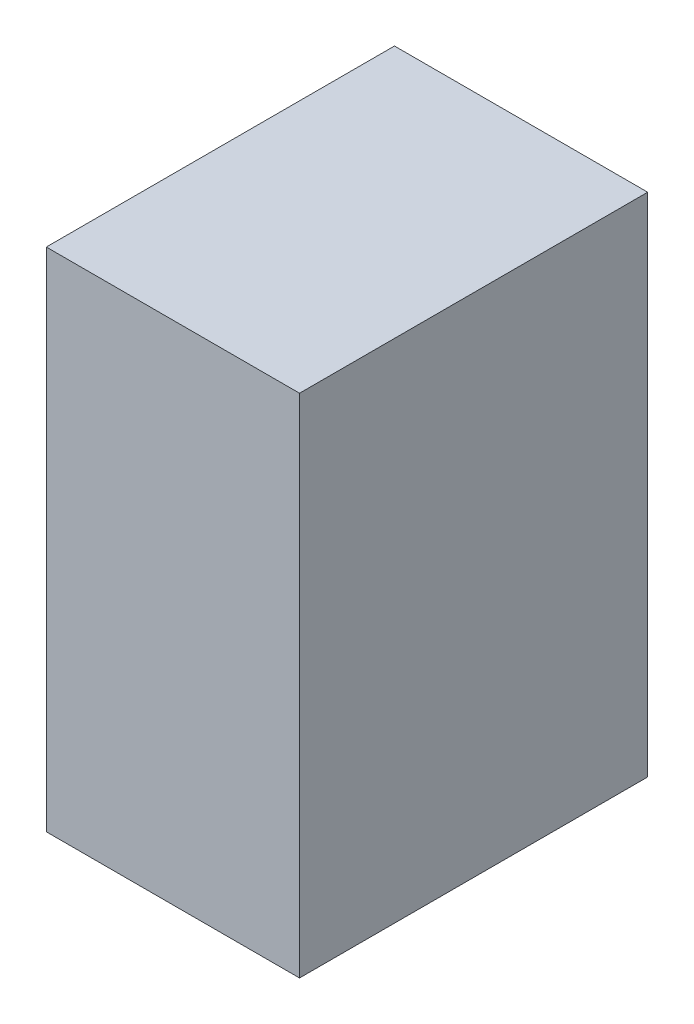
ISO-10303-21;
HEADER;
FILE_DESCRIPTION(('STEP AP214'),'2;1');
FILE_NAME('part.step','',(''),(''),'','','');
FILE_SCHEMA(('AUTOMOTIVE_DESIGN { 1 0 10303 214 1 1 1 1 }'));
ENDSEC;
DATA;
#1=APPLICATION_CONTEXT('core data for automotive mechanical design processes');
#2=APPLICATION_PROTOCOL_DEFINITION('international standard','automotive_design',2000,#1);
#3=PRODUCT_CONTEXT('',#1,'mechanical');
#4=PRODUCT('Part','Part','',(#3));
#5=PRODUCT_RELATED_PRODUCT_CATEGORY('part','',(#4));
#6=PRODUCT_DEFINITION_FORMATION('','',#4);
#7=PRODUCT_DEFINITION_CONTEXT('part definition',#1,'design');
#8=PRODUCT_DEFINITION('design','',#6,#7);
#9=PRODUCT_DEFINITION_SHAPE('','',#8);
#10=(LENGTH_UNIT() NAMED_UNIT(*) SI_UNIT(.MILLI.,.METRE.));
#11=(NAMED_UNIT(*) PLANE_ANGLE_UNIT() SI_UNIT($,.RADIAN.));
#12=(NAMED_UNIT(*) SI_UNIT($,.STERADIAN.) SOLID_ANGLE_UNIT());
#13=UNCERTAINTY_MEASURE_WITH_UNIT(LENGTH_MEASURE(1.E-05),#10,'distance_accuracy_value','');
#14=(GEOMETRIC_REPRESENTATION_CONTEXT(3) GLOBAL_UNCERTAINTY_ASSIGNED_CONTEXT((#13)) GLOBAL_UNIT_ASSIGNED_CONTEXT((#10,
#11,#12)) REPRESENTATION_CONTEXT('',''));
#15=CARTESIAN_POINT('',(0.,0.,0.));
#16=DIRECTION('',(0.,0.,1.));
#17=DIRECTION('',(1.,0.,0.));
#18=AXIS2_PLACEMENT_3D('',#15,#16,#17);
#19=CARTESIAN_POINT('',(-0.1999996,0.3999992,0.));
#20=DIRECTION('',(1.,0.,0.));
#21=DIRECTION('',(0.,0.,-1.));
#22=AXIS2_PLACEMENT_3D('',#19,#20,#21);
#23=PLANE('',#22);
#24=DIRECTION('',(0.,0.,1.));
#25=VECTOR('',#24,1.);
#26=CARTESIAN_POINT('',(-0.1999996,-0.3999992,0.));
#27=LINE('',#26,#25);
#28=CARTESIAN_POINT('',(-0.1999996,-0.3999992,0.));
#29=VERTEX_POINT('',#28);
#30=CARTESIAN_POINT('',(-0.1999996,-0.3999992,0.5499989));
#31=VERTEX_POINT('',#30);
#32=EDGE_CURVE('E20',#29,#31,#27,.T.);
#33=ORIENTED_EDGE('',*,*,#32,.T.);
#34=DIRECTION('',(0.,1.,0.));
#35=VECTOR('',#34,1.);
#36=CARTESIAN_POINT('',(-0.1999996,-0.3999992,0.5499989));
#37=LINE('',#36,#35);
#38=CARTESIAN_POINT('',(-0.1999996,0.3999992,0.5499989));
#39=VERTEX_POINT('',#38);
#40=EDGE_CURVE('E55',#31,#39,#37,.T.);
#41=ORIENTED_EDGE('',*,*,#40,.T.);
#42=DIRECTION('',(0.,0.,-1.));
#43=VECTOR('',#42,1.);
#44=CARTESIAN_POINT('',(-0.1999996,0.3999992,0.));
#45=LINE('',#44,#43);
#46=CARTESIAN_POINT('',(-0.1999996,0.3999992,0.));
#47=VERTEX_POINT('',#46);
#48=EDGE_CURVE('E76',#39,#47,#45,.T.);
#49=ORIENTED_EDGE('',*,*,#48,.T.);
#50=DIRECTION('',(0.,1.,0.));
#51=VECTOR('',#50,1.);
#52=CARTESIAN_POINT('',(-0.1999996,-0.3999992,0.));
#53=LINE('',#52,#51);
#54=EDGE_CURVE('E58',#29,#47,#53,.T.);
#55=ORIENTED_EDGE('',*,*,#54,.F.);
#56=EDGE_LOOP('',(#33,#41,#49,#55));
#57=FACE_BOUND('',#56,.T.);
#58=ADVANCED_FACE('F17',(#57),#23,.F.);
#59=CARTESIAN_POINT('',(-0.1999996,-0.3999992,0.));
#60=DIRECTION('',(0.,1.,0.));
#61=DIRECTION('',(0.,0.,1.));
#62=AXIS2_PLACEMENT_3D('',#59,#60,#61);
#63=PLANE('',#62);
#64=DIRECTION('',(0.,0.,1.));
#65=VECTOR('',#64,1.);
#66=CARTESIAN_POINT('',(0.1999996,-0.3999992,0.));
#67=LINE('',#66,#65);
#68=CARTESIAN_POINT('',(0.1999996,-0.3999992,0.));
#69=VERTEX_POINT('',#68);
#70=CARTESIAN_POINT('',(0.1999996,-0.3999992,0.5499989));
#71=VERTEX_POINT('',#70);
#72=EDGE_CURVE('E73',#69,#71,#67,.T.);
#73=ORIENTED_EDGE('',*,*,#72,.T.);
#74=DIRECTION('',(-1.,0.,0.));
#75=VECTOR('',#74,1.);
#76=CARTESIAN_POINT('',(0.1999996,-0.3999992,0.5499989));
#77=LINE('',#76,#75);
#78=EDGE_CURVE('E63',#71,#31,#77,.T.);
#79=ORIENTED_EDGE('',*,*,#78,.T.);
#80=ORIENTED_EDGE('',*,*,#32,.F.);
#81=DIRECTION('',(-1.,0.,0.));
#82=VECTOR('',#81,1.);
#83=CARTESIAN_POINT('',(0.1999996,-0.3999992,0.));
#84=LINE('',#83,#82);
#85=EDGE_CURVE('E78',#69,#29,#84,.T.);
#86=ORIENTED_EDGE('',*,*,#85,.F.);
#87=EDGE_LOOP('',(#73,#79,#80,#86));
#88=FACE_BOUND('',#87,.T.);
#89=ADVANCED_FACE('F72',(#88),#63,.F.);
#90=CARTESIAN_POINT('',(0.1999996,-0.3999992,0.5499989));
#91=DIRECTION('',(0.,0.,-1.));
#92=DIRECTION('',(-1.,0.,0.));
#93=AXIS2_PLACEMENT_3D('',#90,#91,#92);
#94=PLANE('',#93);
#95=DIRECTION('',(1.,0.,0.));
#96=VECTOR('',#95,1.);
#97=CARTESIAN_POINT('',(0.1999996,0.3999992,0.5499989));
#98=LINE('',#97,#96);
#99=CARTESIAN_POINT('',(0.1999996,0.3999992,0.5499989));
#100=VERTEX_POINT('',#99);
#101=EDGE_CURVE('E69',#100,#39,#98,.F.);
#102=ORIENTED_EDGE('',*,*,#101,.T.);
#103=ORIENTED_EDGE('',*,*,#40,.F.);
#104=ORIENTED_EDGE('',*,*,#78,.F.);
#105=DIRECTION('',(0.,1.,0.));
#106=VECTOR('',#105,1.);
#107=CARTESIAN_POINT('',(0.1999996,-0.3999992,0.5499989));
#108=LINE('',#107,#106);
#109=EDGE_CURVE('E83',#71,#100,#108,.T.);
#110=ORIENTED_EDGE('',*,*,#109,.T.);
#111=EDGE_LOOP('',(#102,#103,#104,#110));
#112=FACE_BOUND('',#111,.T.);
#113=ADVANCED_FACE('F66',(#112),#94,.F.);
#114=CARTESIAN_POINT('',(0.1999996,0.3999992,0.));
#115=DIRECTION('',(0.,-1.,0.));
#116=DIRECTION('',(0.,0.,-1.));
#117=AXIS2_PLACEMENT_3D('',#114,#115,#116);
#118=PLANE('',#117);
#119=ORIENTED_EDGE('',*,*,#48,.F.);
#120=ORIENTED_EDGE('',*,*,#101,.F.);
#121=DIRECTION('',(0.,0.,1.));
#122=VECTOR('',#121,1.);
#123=CARTESIAN_POINT('',(0.1999996,0.3999992,0.));
#124=LINE('',#123,#122);
#125=CARTESIAN_POINT('',(0.1999996,0.3999992,0.));
#126=VERTEX_POINT('',#125);
#127=EDGE_CURVE('E26',#100,#126,#124,.F.);
#128=ORIENTED_EDGE('',*,*,#127,.T.);
#129=DIRECTION('',(-1.,0.,0.));
#130=VECTOR('',#129,1.);
#131=CARTESIAN_POINT('',(0.1999996,0.3999992,0.));
#132=LINE('',#131,#130);
#133=EDGE_CURVE('E34',#47,#126,#132,.F.);
#134=ORIENTED_EDGE('',*,*,#133,.F.);
#135=EDGE_LOOP('',(#119,#120,#128,#134));
#136=FACE_BOUND('',#135,.T.);
#137=ADVANCED_FACE('F88',(#136),#118,.F.);
#138=CARTESIAN_POINT('',(0.1999996,-0.3999992,0.));
#139=DIRECTION('',(0.,0.,-1.));
#140=DIRECTION('',(-1.,0.,0.));
#141=AXIS2_PLACEMENT_3D('',#138,#139,#140);
#142=PLANE('',#141);
#143=ORIENTED_EDGE('',*,*,#133,.T.);
#144=DIRECTION('',(0.,1.,0.));
#145=VECTOR('',#144,1.);
#146=CARTESIAN_POINT('',(0.1999996,-0.3999992,0.));
#147=LINE('',#146,#145);
#148=EDGE_CURVE('E11',#126,#69,#147,.F.);
#149=ORIENTED_EDGE('',*,*,#148,.T.);
#150=ORIENTED_EDGE('',*,*,#85,.T.);
#151=ORIENTED_EDGE('',*,*,#54,.T.);
#152=EDGE_LOOP('',(#143,#149,#150,#151));
#153=FACE_BOUND('',#152,.T.);
#154=ADVANCED_FACE('F91',(#153),#142,.T.);
#155=CARTESIAN_POINT('',(0.1999996,-0.3999992,0.));
#156=DIRECTION('',(-1.,0.,0.));
#157=DIRECTION('',(0.,0.,1.));
#158=AXIS2_PLACEMENT_3D('',#155,#156,#157);
#159=PLANE('',#158);
#160=ORIENTED_EDGE('',*,*,#127,.F.);
#161=ORIENTED_EDGE('',*,*,#109,.F.);
#162=ORIENTED_EDGE('',*,*,#72,.F.);
#163=ORIENTED_EDGE('',*,*,#148,.F.);
#164=EDGE_LOOP('',(#160,#161,#162,#163));
#165=FACE_BOUND('',#164,.T.);
#166=ADVANCED_FACE('F90',(#165),#159,.F.);
#167=CLOSED_SHELL('',(#58,#89,#113,#137,#154,#166));
#168=MANIFOLD_SOLID_BREP('B1',#167);
#169=ADVANCED_BREP_SHAPE_REPRESENTATION('',(#18,#168),#14);
#170=SHAPE_DEFINITION_REPRESENTATION(#9,#169);
ENDSEC;
END-ISO-10303-21;
